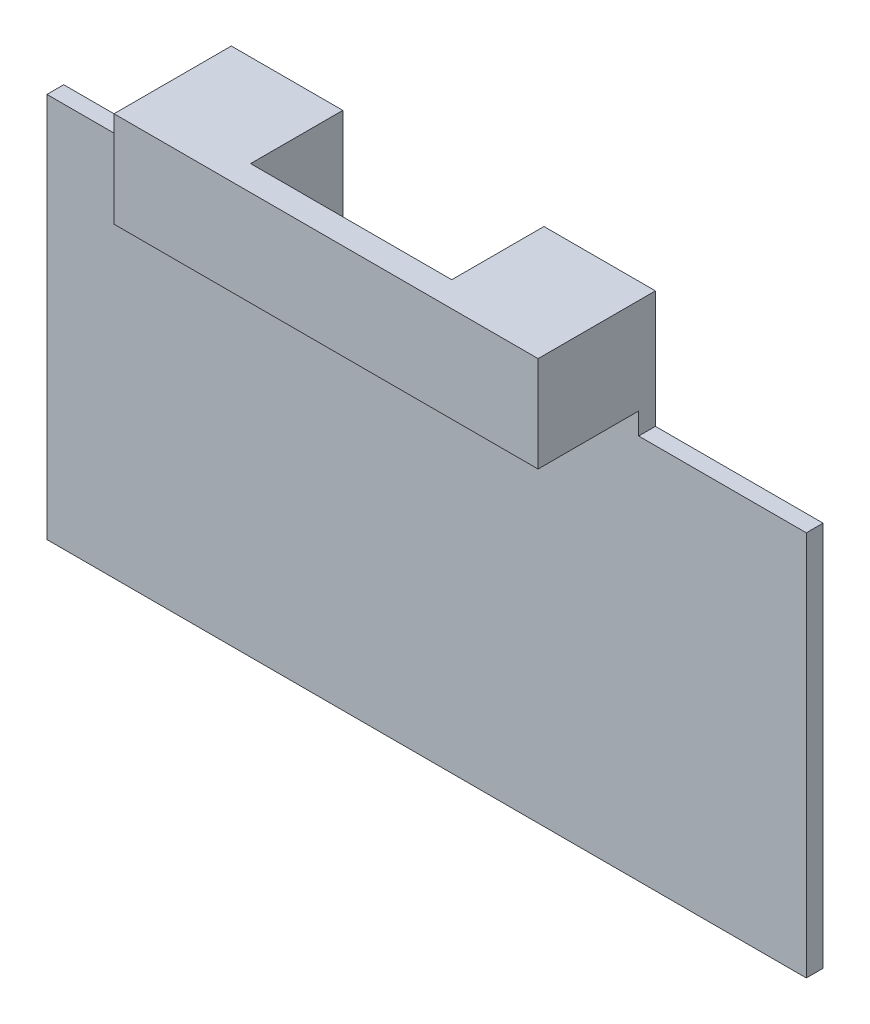
ISO-10303-21;
HEADER;
FILE_DESCRIPTION(('STEP AP214'),'2;1');
FILE_NAME('part.step','',(''),(''),'','','');
FILE_SCHEMA(('AUTOMOTIVE_DESIGN { 1 0 10303 214 1 1 1 1 }'));
ENDSEC;
DATA;
#1=APPLICATION_CONTEXT('core data for automotive mechanical design processes');
#2=APPLICATION_PROTOCOL_DEFINITION('international standard','automotive_design',2000,#1);
#3=PRODUCT_CONTEXT('',#1,'mechanical');
#4=PRODUCT('Part','Part','',(#3));
#5=PRODUCT_RELATED_PRODUCT_CATEGORY('part','',(#4));
#6=PRODUCT_DEFINITION_FORMATION('','',#4);
#7=PRODUCT_DEFINITION_CONTEXT('part definition',#1,'design');
#8=PRODUCT_DEFINITION('design','',#6,#7);
#9=PRODUCT_DEFINITION_SHAPE('','',#8);
#10=(LENGTH_UNIT() NAMED_UNIT(*) SI_UNIT(.MILLI.,.METRE.));
#11=(NAMED_UNIT(*) PLANE_ANGLE_UNIT() SI_UNIT($,.RADIAN.));
#12=(NAMED_UNIT(*) SI_UNIT($,.STERADIAN.) SOLID_ANGLE_UNIT());
#13=UNCERTAINTY_MEASURE_WITH_UNIT(LENGTH_MEASURE(1.E-05),#10,'distance_accuracy_value','');
#14=(GEOMETRIC_REPRESENTATION_CONTEXT(3) GLOBAL_UNCERTAINTY_ASSIGNED_CONTEXT((#13)) GLOBAL_UNIT_ASSIGNED_CONTEXT((#10,
#11,#12)) REPRESENTATION_CONTEXT('',''));
#15=CARTESIAN_POINT('',(0.,0.,0.));
#16=DIRECTION('',(0.,0.,1.));
#17=DIRECTION('',(1.,0.,0.));
#18=AXIS2_PLACEMENT_3D('',#15,#16,#17);
#19=CARTESIAN_POINT('',(-17.0591772151899,26.3772151898734,7.));
#20=DIRECTION('',(1.,0.,0.));
#21=DIRECTION('',(0.,1.,0.));
#22=AXIS2_PLACEMENT_3D('',#19,#20,#21);
#23=PLANE('',#22);
#24=DIRECTION('',(0.,0.,1.));
#25=VECTOR('',#24,1.);
#26=CARTESIAN_POINT('',(-17.0591772151899,19.3772151898734,0.));
#27=LINE('',#26,#25);
#28=CARTESIAN_POINT('',(-17.0591772151899,19.3772151898734,0.));
#29=VERTEX_POINT('',#28);
#30=CARTESIAN_POINT('',(-17.0591772151899,19.3772151898734,1.));
#31=VERTEX_POINT('',#30);
#32=EDGE_CURVE('E163',#29,#31,#27,.T.);
#33=ORIENTED_EDGE('',*,*,#32,.F.);
#34=DIRECTION('',(0.,-1.,0.));
#35=VECTOR('',#34,1.);
#36=CARTESIAN_POINT('',(-17.0591772151899,26.3772151898734,0.));
#37=LINE('',#36,#35);
#38=CARTESIAN_POINT('',(-17.0591772151899,-3.6227848101266,0.));
#39=VERTEX_POINT('',#38);
#40=EDGE_CURVE('E181',#29,#39,#37,.T.);
#41=ORIENTED_EDGE('',*,*,#40,.T.);
#42=DIRECTION('',(0.,0.,-1.));
#43=VECTOR('',#42,1.);
#44=CARTESIAN_POINT('',(-17.0591772151899,-3.6227848101266,7.));
#45=LINE('',#44,#43);
#46=CARTESIAN_POINT('',(-17.0591772151899,-3.6227848101266,1.));
#47=VERTEX_POINT('',#46);
#48=EDGE_CURVE('E295',#47,#39,#45,.T.);
#49=ORIENTED_EDGE('',*,*,#48,.F.);
#50=DIRECTION('',(0.,-1.,0.));
#51=VECTOR('',#50,1.);
#52=CARTESIAN_POINT('',(-17.0591772151899,20.6716008618884,1.));
#53=LINE('',#52,#51);
#54=EDGE_CURVE('E256',#31,#47,#53,.T.);
#55=ORIENTED_EDGE('',*,*,#54,.F.);
#56=EDGE_LOOP('',(#33,#41,#49,#55));
#57=FACE_BOUND('',#56,.T.);
#58=ADVANCED_FACE('F39',(#57),#23,.F.);
#59=CARTESIAN_POINT('',(28.2408227848101,26.3772151898734,7.));
#60=DIRECTION('',(-1.,0.,0.));
#61=DIRECTION('',(0.,-1.,0.));
#62=AXIS2_PLACEMENT_3D('',#59,#60,#61);
#63=PLANE('',#62);
#64=DIRECTION('',(0.,0.,-1.));
#65=VECTOR('',#64,1.);
#66=CARTESIAN_POINT('',(28.2408227848101,19.3772151898734,7.));
#67=LINE('',#66,#65);
#68=CARTESIAN_POINT('',(28.2408227848101,19.3772151898734,1.));
#69=VERTEX_POINT('',#68);
#70=CARTESIAN_POINT('',(28.2408227848101,19.3772151898734,0.));
#71=VERTEX_POINT('',#70);
#72=EDGE_CURVE('E191',#69,#71,#67,.T.);
#73=ORIENTED_EDGE('',*,*,#72,.F.);
#74=DIRECTION('',(0.,1.,0.));
#75=VECTOR('',#74,1.);
#76=CARTESIAN_POINT('',(28.2408227848101,20.6716008618884,1.));
#77=LINE('',#76,#75);
#78=CARTESIAN_POINT('',(28.2408227848101,-3.6227848101266,1.));
#79=VERTEX_POINT('',#78);
#80=EDGE_CURVE('E262',#79,#69,#77,.T.);
#81=ORIENTED_EDGE('',*,*,#80,.F.);
#82=DIRECTION('',(0.,0.,-1.));
#83=VECTOR('',#82,1.);
#84=CARTESIAN_POINT('',(28.2408227848101,-3.6227848101266,7.));
#85=LINE('',#84,#83);
#86=CARTESIAN_POINT('',(28.2408227848101,-3.6227848101266,0.));
#87=VERTEX_POINT('',#86);
#88=EDGE_CURVE('E278',#79,#87,#85,.T.);
#89=ORIENTED_EDGE('',*,*,#88,.T.);
#90=DIRECTION('',(0.,1.,0.));
#91=VECTOR('',#90,1.);
#92=CARTESIAN_POINT('',(28.2408227848101,26.3772151898734,0.));
#93=LINE('',#92,#91);
#94=EDGE_CURVE('E286',#87,#71,#93,.T.);
#95=ORIENTED_EDGE('',*,*,#94,.T.);
#96=EDGE_LOOP('',(#73,#81,#89,#95));
#97=FACE_BOUND('',#96,.T.);
#98=ADVANCED_FACE('F331',(#97),#63,.F.);
#99=CARTESIAN_POINT('',(-17.0591772151899,-3.6227848101266,7.));
#100=DIRECTION('',(0.,1.,0.));
#101=DIRECTION('',(0.,0.,1.));
#102=AXIS2_PLACEMENT_3D('',#99,#100,#101);
#103=PLANE('',#102);
#104=DIRECTION('',(1.,0.,0.));
#105=VECTOR('',#104,1.);
#106=CARTESIAN_POINT('',(-17.0591772151899,-3.6227848101266,1.));
#107=LINE('',#106,#105);
#108=EDGE_CURVE('E259',#47,#79,#107,.T.);
#109=ORIENTED_EDGE('',*,*,#108,.F.);
#110=ORIENTED_EDGE('',*,*,#48,.T.);
#111=DIRECTION('',(1.,0.,0.));
#112=VECTOR('',#111,1.);
#113=CARTESIAN_POINT('',(-17.0591772151899,-3.6227848101266,0.));
#114=LINE('',#113,#112);
#115=EDGE_CURVE('E282',#39,#87,#114,.T.);
#116=ORIENTED_EDGE('',*,*,#115,.T.);
#117=ORIENTED_EDGE('',*,*,#88,.F.);
#118=EDGE_LOOP('',(#109,#110,#116,#117));
#119=FACE_BOUND('',#118,.T.);
#120=ADVANCED_FACE('F370',(#119),#103,.F.);
#121=CARTESIAN_POINT('',(-17.0591772151899,26.3772151898734,7.));
#122=DIRECTION('',(0.,-1.,0.));
#123=DIRECTION('',(0.,0.,-1.));
#124=AXIS2_PLACEMENT_3D('',#121,#122,#123);
#125=PLANE('',#124);
#126=DIRECTION('',(-1.,0.,0.));
#127=VECTOR('',#126,1.);
#128=CARTESIAN_POINT('',(-17.0591772151899,26.3772151898734,7.));
#129=LINE('',#128,#127);
#130=CARTESIAN_POINT('',(18.2408227848101,26.3772151898734,7.));
#131=VERTEX_POINT('',#130);
#132=CARTESIAN_POINT('',(-7.05917721518989,26.3772151898734,7.));
#133=VERTEX_POINT('',#132);
#134=EDGE_CURVE('E274',#131,#133,#129,.T.);
#135=ORIENTED_EDGE('',*,*,#134,.F.);
#136=DIRECTION('',(0.,0.,1.));
#137=VECTOR('',#136,1.);
#138=CARTESIAN_POINT('',(18.2408227848101,26.3772151898734,7.));
#139=LINE('',#138,#137);
#140=CARTESIAN_POINT('',(18.2408227848101,26.3772151898734,0.));
#141=VERTEX_POINT('',#140);
#142=EDGE_CURVE('E195',#141,#131,#139,.T.);
#143=ORIENTED_EDGE('',*,*,#142,.F.);
#144=DIRECTION('',(-1.,0.,0.));
#145=VECTOR('',#144,1.);
#146=CARTESIAN_POINT('',(-17.0591772151899,26.3772151898734,0.));
#147=LINE('',#146,#145);
#148=CARTESIAN_POINT('',(11.5908227848101,26.3772151898734,0.));
#149=VERTEX_POINT('',#148);
#150=EDGE_CURVE('E279',#141,#149,#147,.T.);
#151=ORIENTED_EDGE('',*,*,#150,.T.);
#152=DIRECTION('',(0.,0.,-1.));
#153=VECTOR('',#152,1.);
#154=CARTESIAN_POINT('',(11.5908227848101,26.3772151898734,0.));
#155=LINE('',#154,#153);
#156=CARTESIAN_POINT('',(11.5908227848101,26.3772151898734,5.5));
#157=VERTEX_POINT('',#156);
#158=EDGE_CURVE('E212',#157,#149,#155,.T.);
#159=ORIENTED_EDGE('',*,*,#158,.F.);
#160=DIRECTION('',(1.,0.,0.));
#161=VECTOR('',#160,1.);
#162=CARTESIAN_POINT('',(-0.409177215189892,26.3772151898734,5.5));
#163=LINE('',#162,#161);
#164=CARTESIAN_POINT('',(-0.409177215189892,26.3772151898734,5.5));
#165=VERTEX_POINT('',#164);
#166=EDGE_CURVE('E223',#165,#157,#163,.T.);
#167=ORIENTED_EDGE('',*,*,#166,.F.);
#168=DIRECTION('',(0.,0.,1.));
#169=VECTOR('',#168,1.);
#170=CARTESIAN_POINT('',(-0.409177215189893,26.3772151898734,0.));
#171=LINE('',#170,#169);
#172=CARTESIAN_POINT('',(-0.409177215189893,26.3772151898734,0.));
#173=VERTEX_POINT('',#172);
#174=EDGE_CURVE('E174',#173,#165,#171,.T.);
#175=ORIENTED_EDGE('',*,*,#174,.F.);
#176=CARTESIAN_POINT('',(-7.05917721518989,26.3772151898734,0.));
#177=VERTEX_POINT('',#176);
#178=EDGE_CURVE('E290',#173,#177,#147,.T.);
#179=ORIENTED_EDGE('',*,*,#178,.T.);
#180=DIRECTION('',(0.,0.,-1.));
#181=VECTOR('',#180,1.);
#182=CARTESIAN_POINT('',(-7.05917721518989,26.3772151898734,0.));
#183=LINE('',#182,#181);
#184=EDGE_CURVE('E169',#133,#177,#183,.T.);
#185=ORIENTED_EDGE('',*,*,#184,.F.);
#186=EDGE_LOOP('',(#135,#143,#151,#159,#167,#175,#179,#185));
#187=FACE_BOUND('',#186,.T.);
#188=ADVANCED_FACE('F339',(#187),#125,.F.);
#189=CARTESIAN_POINT('',(0.,0.,7.));
#190=DIRECTION('',(0.,0.,1.));
#191=DIRECTION('',(1.,0.,0.));
#192=AXIS2_PLACEMENT_3D('',#189,#190,#191);
#193=PLANE('',#192);
#194=DIRECTION('',(0.,1.,0.));
#195=VECTOR('',#194,1.);
#196=CARTESIAN_POINT('',(18.2408227848101,19.3772151898734,7.));
#197=LINE('',#196,#195);
#198=CARTESIAN_POINT('',(18.2408227848101,20.6716008618884,7.));
#199=VERTEX_POINT('',#198);
#200=EDGE_CURVE('E189',#199,#131,#197,.T.);
#201=ORIENTED_EDGE('',*,*,#200,.T.);
#202=ORIENTED_EDGE('',*,*,#134,.T.);
#203=DIRECTION('',(0.,1.,0.));
#204=VECTOR('',#203,1.);
#205=CARTESIAN_POINT('',(-7.05917721518989,19.3772151898734,7.));
#206=LINE('',#205,#204);
#207=CARTESIAN_POINT('',(-7.05917721518989,20.6716008618884,7.));
#208=VERTEX_POINT('',#207);
#209=EDGE_CURVE('E175',#208,#133,#206,.T.);
#210=ORIENTED_EDGE('',*,*,#209,.F.);
#211=DIRECTION('',(-1.,0.,0.));
#212=VECTOR('',#211,1.);
#213=CARTESIAN_POINT('',(-17.0591772151899,20.6716008618884,7.));
#214=LINE('',#213,#212);
#215=EDGE_CURVE('E255',#199,#208,#214,.T.);
#216=ORIENTED_EDGE('',*,*,#215,.F.);
#217=EDGE_LOOP('',(#201,#202,#210,#216));
#218=FACE_BOUND('',#217,.T.);
#219=ADVANCED_FACE('F343',(#218),#193,.T.);
#220=CARTESIAN_POINT('',(0.,0.,0.));
#221=DIRECTION('',(0.,0.,1.));
#222=DIRECTION('',(1.,0.,0.));
#223=AXIS2_PLACEMENT_3D('',#220,#221,#222);
#224=PLANE('',#223);
#225=ORIENTED_EDGE('',*,*,#150,.F.);
#226=DIRECTION('',(0.,1.,0.));
#227=VECTOR('',#226,1.);
#228=CARTESIAN_POINT('',(18.2408227848101,19.3772151898734,0.));
#229=LINE('',#228,#227);
#230=CARTESIAN_POINT('',(18.2408227848101,19.3772151898734,0.));
#231=VERTEX_POINT('',#230);
#232=EDGE_CURVE('E200',#231,#141,#229,.T.);
#233=ORIENTED_EDGE('',*,*,#232,.F.);
#234=DIRECTION('',(-1.,0.,0.));
#235=VECTOR('',#234,1.);
#236=CARTESIAN_POINT('',(28.2408227848101,19.3772151898734,0.));
#237=LINE('',#236,#235);
#238=EDGE_CURVE('E194',#71,#231,#237,.T.);
#239=ORIENTED_EDGE('',*,*,#238,.F.);
#240=ORIENTED_EDGE('',*,*,#94,.F.);
#241=ORIENTED_EDGE('',*,*,#115,.F.);
#242=ORIENTED_EDGE('',*,*,#40,.F.);
#243=DIRECTION('',(-1.,0.,0.));
#244=VECTOR('',#243,1.);
#245=CARTESIAN_POINT('',(-17.0591772151899,19.3772151898734,0.));
#246=LINE('',#245,#244);
#247=CARTESIAN_POINT('',(-7.05917721518989,19.3772151898734,0.));
#248=VERTEX_POINT('',#247);
#249=EDGE_CURVE('E156',#248,#29,#246,.T.);
#250=ORIENTED_EDGE('',*,*,#249,.F.);
#251=DIRECTION('',(0.,1.,0.));
#252=VECTOR('',#251,1.);
#253=CARTESIAN_POINT('',(-7.05917721518989,19.3772151898734,0.));
#254=LINE('',#253,#252);
#255=EDGE_CURVE('E166',#248,#177,#254,.T.);
#256=ORIENTED_EDGE('',*,*,#255,.T.);
#257=ORIENTED_EDGE('',*,*,#178,.F.);
#258=DIRECTION('',(0.,1.,0.));
#259=VECTOR('',#258,1.);
#260=CARTESIAN_POINT('',(-0.409177215189893,19.3772151898734,0.));
#261=LINE('',#260,#259);
#262=CARTESIAN_POINT('',(-0.409177215189893,19.3772151898734,0.));
#263=VERTEX_POINT('',#262);
#264=EDGE_CURVE('E229',#263,#173,#261,.T.);
#265=ORIENTED_EDGE('',*,*,#264,.F.);
#266=DIRECTION('',(-1.,0.,0.));
#267=VECTOR('',#266,1.);
#268=CARTESIAN_POINT('',(-0.409177215189893,19.3772151898734,0.));
#269=LINE('',#268,#267);
#270=CARTESIAN_POINT('',(11.5908227848101,19.3772151898734,0.));
#271=VERTEX_POINT('',#270);
#272=EDGE_CURVE('E215',#271,#263,#269,.T.);
#273=ORIENTED_EDGE('',*,*,#272,.F.);
#274=DIRECTION('',(0.,1.,0.));
#275=VECTOR('',#274,1.);
#276=CARTESIAN_POINT('',(11.5908227848101,19.3772151898734,0.));
#277=LINE('',#276,#275);
#278=EDGE_CURVE('E54',#271,#149,#277,.T.);
#279=ORIENTED_EDGE('',*,*,#278,.T.);
#280=EDGE_LOOP('',(#225,#233,#239,#240,#241,#242,#250,#256,#257,#265,#273,#279));
#281=FACE_BOUND('',#280,.T.);
#282=ADVANCED_FACE('F179',(#281),#224,.F.);
#283=CARTESIAN_POINT('',(-17.0591772151899,20.6716008618884,1.));
#284=DIRECTION('',(0.,1.,0.));
#285=DIRECTION('',(0.,0.,1.));
#286=AXIS2_PLACEMENT_3D('',#283,#284,#285);
#287=PLANE('',#286);
#288=DIRECTION('',(-1.,0.,0.));
#289=VECTOR('',#288,1.);
#290=CARTESIAN_POINT('',(-17.0591772151899,20.6716008618884,1.));
#291=LINE('',#290,#289);
#292=CARTESIAN_POINT('',(18.2408227848101,20.6716008618884,1.));
#293=VERTEX_POINT('',#292);
#294=CARTESIAN_POINT('',(11.5908227848101,20.6716008618884,1.));
#295=VERTEX_POINT('',#294);
#296=EDGE_CURVE('E270',#293,#295,#291,.T.);
#297=ORIENTED_EDGE('',*,*,#296,.F.);
#298=DIRECTION('',(0.,0.,1.));
#299=VECTOR('',#298,1.);
#300=CARTESIAN_POINT('',(18.2408227848101,20.6716008618884,1.));
#301=LINE('',#300,#299);
#302=EDGE_CURVE('E251',#293,#199,#301,.T.);
#303=ORIENTED_EDGE('',*,*,#302,.T.);
#304=ORIENTED_EDGE('',*,*,#215,.T.);
#305=DIRECTION('',(0.,0.,-1.));
#306=VECTOR('',#305,1.);
#307=CARTESIAN_POINT('',(-7.05917721518989,20.6716008618884,0.999999999999996));
#308=LINE('',#307,#306);
#309=CARTESIAN_POINT('',(-7.05917721518989,20.6716008618884,1.));
#310=VERTEX_POINT('',#309);
#311=EDGE_CURVE('E247',#208,#310,#308,.T.);
#312=ORIENTED_EDGE('',*,*,#311,.T.);
#313=CARTESIAN_POINT('',(-0.409177215189893,20.6716008618884,1.));
#314=VERTEX_POINT('',#313);
#315=EDGE_CURVE('E266',#314,#310,#291,.T.);
#316=ORIENTED_EDGE('',*,*,#315,.F.);
#317=DIRECTION('',(0.,0.,1.));
#318=VECTOR('',#317,1.);
#319=CARTESIAN_POINT('',(-0.409177215189894,20.6716008618884,0.999999999999997));
#320=LINE('',#319,#318);
#321=CARTESIAN_POINT('',(-0.409177215189892,20.6716008618884,5.5));
#322=VERTEX_POINT('',#321);
#323=EDGE_CURVE('E243',#314,#322,#320,.T.);
#324=ORIENTED_EDGE('',*,*,#323,.T.);
#325=DIRECTION('',(1.,0.,0.));
#326=VECTOR('',#325,1.);
#327=CARTESIAN_POINT('',(-17.0591772151899,20.6716008618884,5.5));
#328=LINE('',#327,#326);
#329=CARTESIAN_POINT('',(11.5908227848101,20.6716008618884,5.5));
#330=VERTEX_POINT('',#329);
#331=EDGE_CURVE('E11',#322,#330,#328,.T.);
#332=ORIENTED_EDGE('',*,*,#331,.T.);
#333=DIRECTION('',(0.,0.,-1.));
#334=VECTOR('',#333,1.);
#335=CARTESIAN_POINT('',(11.5908227848101,20.6716008618884,1.));
#336=LINE('',#335,#334);
#337=EDGE_CURVE('E232',#330,#295,#336,.T.);
#338=ORIENTED_EDGE('',*,*,#337,.T.);
#339=EDGE_LOOP('',(#297,#303,#304,#312,#316,#324,#332,#338));
#340=FACE_BOUND('',#339,.T.);
#341=ADVANCED_FACE('F346',(#340),#287,.F.);
#342=CARTESIAN_POINT('',(0.,0.,1.));
#343=DIRECTION('',(0.,0.,1.));
#344=DIRECTION('',(1.,0.,0.));
#345=AXIS2_PLACEMENT_3D('',#342,#343,#344);
#346=PLANE('',#345);
#347=DIRECTION('',(0.,-1.,0.));
#348=VECTOR('',#347,1.);
#349=CARTESIAN_POINT('',(18.2408227848101,0.,1.));
#350=LINE('',#349,#348);
#351=CARTESIAN_POINT('',(18.2408227848101,19.3772151898734,1.));
#352=VERTEX_POINT('',#351);
#353=EDGE_CURVE('E47',#293,#352,#350,.T.);
#354=ORIENTED_EDGE('',*,*,#353,.F.);
#355=ORIENTED_EDGE('',*,*,#296,.T.);
#356=DIRECTION('',(0.,1.,0.));
#357=VECTOR('',#356,1.);
#358=CARTESIAN_POINT('',(11.5908227848101,0.,1.));
#359=LINE('',#358,#357);
#360=CARTESIAN_POINT('',(11.5908227848101,19.3772151898734,1.));
#361=VERTEX_POINT('',#360);
#362=EDGE_CURVE('E303',#361,#295,#359,.T.);
#363=ORIENTED_EDGE('',*,*,#362,.F.);
#364=DIRECTION('',(-1.,0.,0.));
#365=VECTOR('',#364,1.);
#366=CARTESIAN_POINT('',(0.,19.3772151898734,1.));
#367=LINE('',#366,#365);
#368=CARTESIAN_POINT('',(-0.409177215189893,19.3772151898734,1.));
#369=VERTEX_POINT('',#368);
#370=EDGE_CURVE('E299',#361,#369,#367,.T.);
#371=ORIENTED_EDGE('',*,*,#370,.T.);
#372=DIRECTION('',(0.,-1.,0.));
#373=VECTOR('',#372,1.);
#374=CARTESIAN_POINT('',(-0.409177215189893,0.,1.));
#375=LINE('',#374,#373);
#376=EDGE_CURVE('E306',#314,#369,#375,.T.);
#377=ORIENTED_EDGE('',*,*,#376,.F.);
#378=ORIENTED_EDGE('',*,*,#315,.T.);
#379=DIRECTION('',(0.,1.,0.));
#380=VECTOR('',#379,1.);
#381=CARTESIAN_POINT('',(-7.05917721518989,0.,1.));
#382=LINE('',#381,#380);
#383=CARTESIAN_POINT('',(-7.05917721518989,19.3772151898734,1.));
#384=VERTEX_POINT('',#383);
#385=EDGE_CURVE('E312',#384,#310,#382,.T.);
#386=ORIENTED_EDGE('',*,*,#385,.F.);
#387=DIRECTION('',(-1.,0.,0.));
#388=VECTOR('',#387,1.);
#389=CARTESIAN_POINT('',(0.,19.3772151898734,1.));
#390=LINE('',#389,#388);
#391=EDGE_CURVE('E159',#384,#31,#390,.T.);
#392=ORIENTED_EDGE('',*,*,#391,.T.);
#393=ORIENTED_EDGE('',*,*,#54,.T.);
#394=ORIENTED_EDGE('',*,*,#108,.T.);
#395=ORIENTED_EDGE('',*,*,#80,.T.);
#396=DIRECTION('',(-1.,0.,0.));
#397=VECTOR('',#396,1.);
#398=CARTESIAN_POINT('',(0.,19.3772151898734,1.));
#399=LINE('',#398,#397);
#400=EDGE_CURVE('E315',#69,#352,#399,.T.);
#401=ORIENTED_EDGE('',*,*,#400,.T.);
#402=EDGE_LOOP('',(#354,#355,#363,#371,#377,#378,#386,#392,#393,#394,#395,#401));
#403=FACE_BOUND('',#402,.T.);
#404=ADVANCED_FACE('F325',(#403),#346,.T.);
#405=CARTESIAN_POINT('',(-0.409177215189892,19.3772151898734,5.5));
#406=DIRECTION('',(0.,0.,1.));
#407=DIRECTION('',(1.,0.,0.));
#408=AXIS2_PLACEMENT_3D('',#405,#406,#407);
#409=PLANE('',#408);
#410=DIRECTION('',(0.,1.,0.));
#411=VECTOR('',#410,1.);
#412=CARTESIAN_POINT('',(-0.409177215189892,19.3772151898734,5.5));
#413=LINE('',#412,#411);
#414=EDGE_CURVE('E219',#322,#165,#413,.T.);
#415=ORIENTED_EDGE('',*,*,#414,.T.);
#416=ORIENTED_EDGE('',*,*,#166,.T.);
#417=DIRECTION('',(0.,1.,0.));
#418=VECTOR('',#417,1.);
#419=CARTESIAN_POINT('',(11.5908227848101,19.3772151898734,5.5));
#420=LINE('',#419,#418);
#421=EDGE_CURVE('E235',#330,#157,#420,.T.);
#422=ORIENTED_EDGE('',*,*,#421,.F.);
#423=ORIENTED_EDGE('',*,*,#331,.F.);
#424=EDGE_LOOP('',(#415,#416,#422,#423));
#425=FACE_BOUND('',#424,.T.);
#426=ADVANCED_FACE('F363',(#425),#409,.F.);
#427=CARTESIAN_POINT('',(-0.409177215189893,19.3772151898734,0.));
#428=DIRECTION('',(-1.,0.,0.));
#429=DIRECTION('',(0.,0.,1.));
#430=AXIS2_PLACEMENT_3D('',#427,#428,#429);
#431=PLANE('',#430);
#432=ORIENTED_EDGE('',*,*,#376,.T.);
#433=DIRECTION('',(0.,0.,1.));
#434=VECTOR('',#433,1.);
#435=CARTESIAN_POINT('',(-0.409177215189893,19.3772151898734,0.));
#436=LINE('',#435,#434);
#437=EDGE_CURVE('E208',#263,#369,#436,.T.);
#438=ORIENTED_EDGE('',*,*,#437,.F.);
#439=ORIENTED_EDGE('',*,*,#264,.T.);
#440=ORIENTED_EDGE('',*,*,#174,.T.);
#441=ORIENTED_EDGE('',*,*,#414,.F.);
#442=ORIENTED_EDGE('',*,*,#323,.F.);
#443=EDGE_LOOP('',(#432,#438,#439,#440,#441,#442));
#444=FACE_BOUND('',#443,.T.);
#445=ADVANCED_FACE('F359',(#444),#431,.F.);
#446=CARTESIAN_POINT('',(11.5908227848101,19.3772151898734,0.));
#447=DIRECTION('',(1.,0.,0.));
#448=DIRECTION('',(0.,0.,-1.));
#449=AXIS2_PLACEMENT_3D('',#446,#447,#448);
#450=PLANE('',#449);
#451=ORIENTED_EDGE('',*,*,#421,.T.);
#452=ORIENTED_EDGE('',*,*,#158,.T.);
#453=ORIENTED_EDGE('',*,*,#278,.F.);
#454=DIRECTION('',(0.,0.,-1.));
#455=VECTOR('',#454,1.);
#456=CARTESIAN_POINT('',(11.5908227848101,19.3772151898734,0.));
#457=LINE('',#456,#455);
#458=EDGE_CURVE('E211',#361,#271,#457,.T.);
#459=ORIENTED_EDGE('',*,*,#458,.F.);
#460=ORIENTED_EDGE('',*,*,#362,.T.);
#461=ORIENTED_EDGE('',*,*,#337,.F.);
#462=EDGE_LOOP('',(#451,#452,#453,#459,#460,#461));
#463=FACE_BOUND('',#462,.T.);
#464=ADVANCED_FACE('F351',(#463),#450,.F.);
#465=CARTESIAN_POINT('',(0.,19.3772151898734,0.));
#466=DIRECTION('',(0.,1.,0.));
#467=DIRECTION('',(0.,0.,1.));
#468=AXIS2_PLACEMENT_3D('',#465,#466,#467);
#469=PLANE('',#468);
#470=ORIENTED_EDGE('',*,*,#458,.T.);
#471=ORIENTED_EDGE('',*,*,#272,.T.);
#472=ORIENTED_EDGE('',*,*,#437,.T.);
#473=ORIENTED_EDGE('',*,*,#370,.F.);
#474=EDGE_LOOP('',(#470,#471,#472,#473));
#475=FACE_BOUND('',#474,.T.);
#476=ADVANCED_FACE('F355',(#475),#469,.T.);
#477=CARTESIAN_POINT('',(-7.05917721518989,19.3772151898734,0.));
#478=DIRECTION('',(1.,0.,0.));
#479=DIRECTION('',(0.,0.,-1.));
#480=AXIS2_PLACEMENT_3D('',#477,#478,#479);
#481=PLANE('',#480);
#482=ORIENTED_EDGE('',*,*,#209,.T.);
#483=ORIENTED_EDGE('',*,*,#184,.T.);
#484=ORIENTED_EDGE('',*,*,#255,.F.);
#485=DIRECTION('',(0.,0.,-1.));
#486=VECTOR('',#485,1.);
#487=CARTESIAN_POINT('',(-7.05917721518989,19.3772151898734,0.));
#488=LINE('',#487,#486);
#489=EDGE_CURVE('E152',#384,#248,#488,.T.);
#490=ORIENTED_EDGE('',*,*,#489,.F.);
#491=ORIENTED_EDGE('',*,*,#385,.T.);
#492=ORIENTED_EDGE('',*,*,#311,.F.);
#493=EDGE_LOOP('',(#482,#483,#484,#490,#491,#492));
#494=FACE_BOUND('',#493,.T.);
#495=ADVANCED_FACE('F167',(#494),#481,.F.);
#496=CARTESIAN_POINT('',(0.,19.3772151898734,0.));
#497=DIRECTION('',(0.,1.,0.));
#498=DIRECTION('',(0.,0.,1.));
#499=AXIS2_PLACEMENT_3D('',#496,#497,#498);
#500=PLANE('',#499);
#501=ORIENTED_EDGE('',*,*,#489,.T.);
#502=ORIENTED_EDGE('',*,*,#249,.T.);
#503=ORIENTED_EDGE('',*,*,#32,.T.);
#504=ORIENTED_EDGE('',*,*,#391,.F.);
#505=EDGE_LOOP('',(#501,#502,#503,#504));
#506=FACE_BOUND('',#505,.T.);
#507=ADVANCED_FACE('F154',(#506),#500,.T.);
#508=CARTESIAN_POINT('',(18.2408227848101,19.3772151898734,7.));
#509=DIRECTION('',(-1.,0.,0.));
#510=DIRECTION('',(0.,0.,1.));
#511=AXIS2_PLACEMENT_3D('',#508,#509,#510);
#512=PLANE('',#511);
#513=ORIENTED_EDGE('',*,*,#353,.T.);
#514=DIRECTION('',(0.,0.,1.));
#515=VECTOR('',#514,1.);
#516=CARTESIAN_POINT('',(18.2408227848101,19.3772151898734,7.));
#517=LINE('',#516,#515);
#518=EDGE_CURVE('E62',#231,#352,#517,.T.);
#519=ORIENTED_EDGE('',*,*,#518,.F.);
#520=ORIENTED_EDGE('',*,*,#232,.T.);
#521=ORIENTED_EDGE('',*,*,#142,.T.);
#522=ORIENTED_EDGE('',*,*,#200,.F.);
#523=ORIENTED_EDGE('',*,*,#302,.F.);
#524=EDGE_LOOP('',(#513,#519,#520,#521,#522,#523));
#525=FACE_BOUND('',#524,.T.);
#526=ADVANCED_FACE('F321',(#525),#512,.F.);
#527=CARTESIAN_POINT('',(0.,19.3772151898734,0.));
#528=DIRECTION('',(0.,1.,0.));
#529=DIRECTION('',(0.,0.,1.));
#530=AXIS2_PLACEMENT_3D('',#527,#528,#529);
#531=PLANE('',#530);
#532=ORIENTED_EDGE('',*,*,#72,.T.);
#533=ORIENTED_EDGE('',*,*,#238,.T.);
#534=ORIENTED_EDGE('',*,*,#518,.T.);
#535=ORIENTED_EDGE('',*,*,#400,.F.);
#536=EDGE_LOOP('',(#532,#533,#534,#535));
#537=FACE_BOUND('',#536,.T.);
#538=ADVANCED_FACE('F328',(#537),#531,.T.);
#539=CLOSED_SHELL('',(#58,#98,#120,#188,#219,#282,#341,#404,#426,#445,#464,#476,#495,#507,#526,#538));
#540=MANIFOLD_SOLID_BREP('B2',#539);
#541=ADVANCED_BREP_SHAPE_REPRESENTATION('',(#18,#540),#14);
#542=SHAPE_DEFINITION_REPRESENTATION(#9,#541);
ENDSEC;
END-ISO-10303-21;
